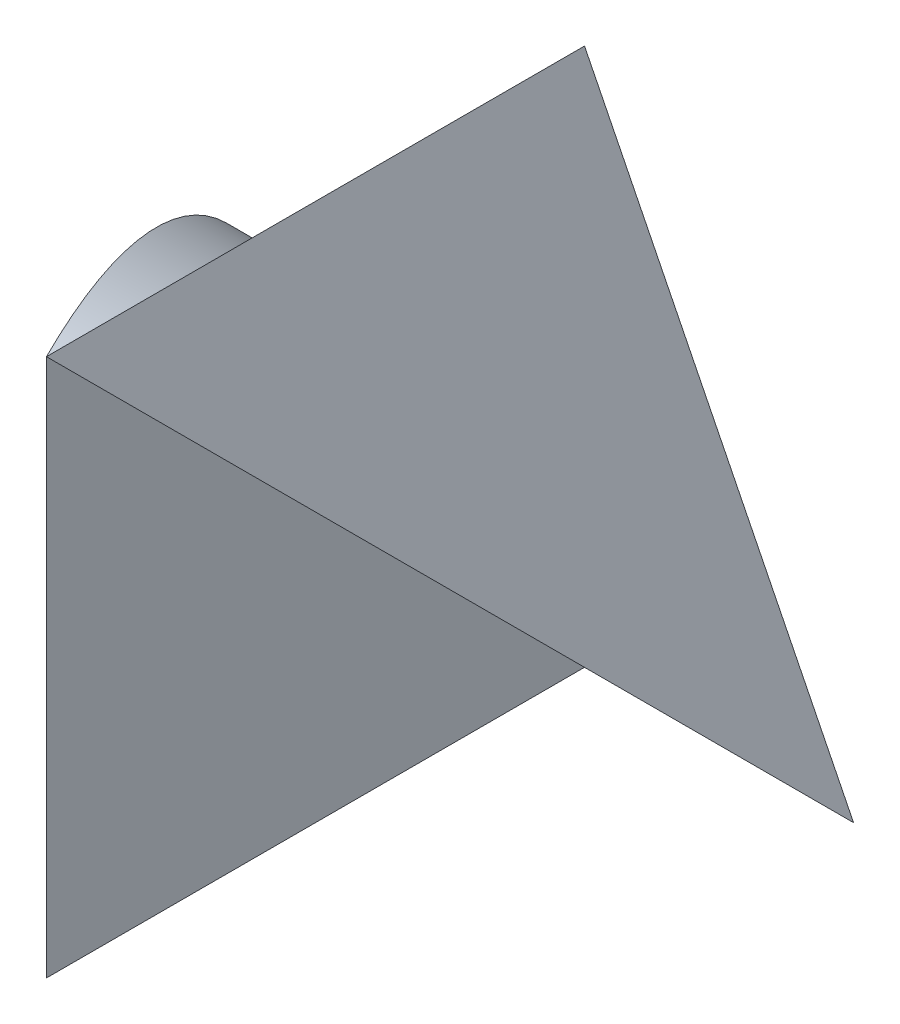
ISO-10303-21;
HEADER;
FILE_DESCRIPTION(('STEP AP214'),'2;1');
FILE_NAME('part.step','',(''),(''),'','','');
FILE_SCHEMA(('AUTOMOTIVE_DESIGN { 1 0 10303 214 1 1 1 1 }'));
ENDSEC;
DATA;
#1=APPLICATION_CONTEXT('core data for automotive mechanical design processes');
#2=APPLICATION_PROTOCOL_DEFINITION('international standard','automotive_design',2000,#1);
#3=PRODUCT_CONTEXT('',#1,'mechanical');
#4=PRODUCT('Part','Part','',(#3));
#5=PRODUCT_RELATED_PRODUCT_CATEGORY('part','',(#4));
#6=PRODUCT_DEFINITION_FORMATION('','',#4);
#7=PRODUCT_DEFINITION_CONTEXT('part definition',#1,'design');
#8=PRODUCT_DEFINITION('design','',#6,#7);
#9=PRODUCT_DEFINITION_SHAPE('','',#8);
#10=(LENGTH_UNIT() NAMED_UNIT(*) SI_UNIT(.MILLI.,.METRE.));
#11=(NAMED_UNIT(*) PLANE_ANGLE_UNIT() SI_UNIT($,.RADIAN.));
#12=(NAMED_UNIT(*) SI_UNIT($,.STERADIAN.) SOLID_ANGLE_UNIT());
#13=UNCERTAINTY_MEASURE_WITH_UNIT(LENGTH_MEASURE(1.E-05),#10,'distance_accuracy_value','');
#14=(GEOMETRIC_REPRESENTATION_CONTEXT(3) GLOBAL_UNCERTAINTY_ASSIGNED_CONTEXT((#13)) GLOBAL_UNIT_ASSIGNED_CONTEXT((#10,
#11,#12)) REPRESENTATION_CONTEXT('',''));
#15=CARTESIAN_POINT('',(0.,0.,0.));
#16=DIRECTION('',(0.,0.,1.));
#17=DIRECTION('',(1.,0.,0.));
#18=AXIS2_PLACEMENT_3D('',#15,#16,#17);
#19=CARTESIAN_POINT('',(-2.,4.,-2.));
#20=DIRECTION('',(0.,0.,1.));
#21=DIRECTION('',(1.,0.,0.));
#22=AXIS2_PLACEMENT_3D('',#19,#20,#21);
#23=PLANE('',#22);
#24=DIRECTION('',(0.,-1.,0.));
#25=VECTOR('',#24,1.);
#26=CARTESIAN_POINT('',(0.,4.,-2.));
#27=LINE('',#26,#25);
#28=CARTESIAN_POINT('',(0.,4.,-2.));
#29=VERTEX_POINT('',#28);
#30=CARTESIAN_POINT('',(0.,0.,-2.));
#31=VERTEX_POINT('',#30);
#32=EDGE_CURVE('E103',#29,#31,#27,.T.);
#33=ORIENTED_EDGE('',*,*,#32,.F.);
#34=DIRECTION('',(-0.447213595499958,0.894427190999916,0.));
#35=VECTOR('',#34,1.);
#36=CARTESIAN_POINT('',(0.,4.,-2.));
#37=LINE('',#36,#35);
#38=CARTESIAN_POINT('',(2.,0.,-2.));
#39=VERTEX_POINT('',#38);
#40=EDGE_CURVE('E47',#29,#39,#37,.F.);
#41=ORIENTED_EDGE('',*,*,#40,.T.);
#42=DIRECTION('',(-1.,0.,0.));
#43=VECTOR('',#42,1.);
#44=CARTESIAN_POINT('',(-2.,0.,-2.));
#45=LINE('',#44,#43);
#46=EDGE_CURVE('E80',#39,#31,#45,.T.);
#47=ORIENTED_EDGE('',*,*,#46,.T.);
#48=EDGE_LOOP('',(#33,#41,#47));
#49=FACE_BOUND('',#48,.T.);
#50=ADVANCED_FACE('F38',(#49),#23,.F.);
#51=CARTESIAN_POINT('',(0.,0.,0.));
#52=DIRECTION('',(0.,-1.,0.));
#53=DIRECTION('',(0.,0.,-1.));
#54=AXIS2_PLACEMENT_3D('',#51,#52,#53);
#55=PLANE('',#54);
#56=DIRECTION('',(0.,0.,-1.));
#57=VECTOR('',#56,1.);
#58=CARTESIAN_POINT('',(0.,0.,2.));
#59=LINE('',#58,#57);
#60=CARTESIAN_POINT('',(0.,0.,2.));
#61=VERTEX_POINT('',#60);
#62=EDGE_CURVE('E83',#61,#31,#59,.T.);
#63=ORIENTED_EDGE('',*,*,#62,.F.);
#64=DIRECTION('',(-0.447213595499958,0.,-0.894427190999916));
#65=VECTOR('',#64,1.);
#66=CARTESIAN_POINT('',(-2.,0.,-2.));
#67=LINE('',#66,#65);
#68=CARTESIAN_POINT('',(-2.,0.,-2.));
#69=VERTEX_POINT('',#68);
#70=EDGE_CURVE('E108',#61,#69,#67,.T.);
#71=ORIENTED_EDGE('',*,*,#70,.T.);
#72=DIRECTION('',(-1.,0.,0.));
#73=VECTOR('',#72,1.);
#74=CARTESIAN_POINT('',(-1.,0.,-1.99999999999999));
#75=LINE('',#74,#73);
#76=EDGE_CURVE('E55',#31,#69,#75,.T.);
#77=ORIENTED_EDGE('',*,*,#76,.F.);
#78=EDGE_LOOP('',(#63,#71,#77));
#79=FACE_BOUND('',#78,.T.);
#80=ADVANCED_FACE('F107',(#79),#55,.T.);
#81=CARTESIAN_POINT('',(-0.799999999999998,0.,0.399999999999999));
#82=DIRECTION('',(0.894427190999916,0.,-0.447213595499958));
#83=DIRECTION('',(-0.447213595499958,0.,-0.894427190999916));
#84=AXIS2_PLACEMENT_3D('',#81,#82,#83);
#85=PLANE('',#84);
#86=ORIENTED_EDGE('',*,*,#70,.F.);
#87=DIRECTION('',(0.,-1.,0.));
#88=VECTOR('',#87,1.);
#89=CARTESIAN_POINT('',(0.,0.,2.));
#90=LINE('',#89,#88);
#91=CARTESIAN_POINT('',(0.,3.99999999999955,2.));
#92=VERTEX_POINT('',#91);
#93=EDGE_CURVE('E88',#92,#61,#90,.T.);
#94=ORIENTED_EDGE('',*,*,#93,.F.);
#95=CARTESIAN_POINT('',(0.00684022848994022,-0.51710057122485,2.01368045697988));
#96=DIRECTION('',(0.894427190999916,0.,-0.447213595499958));
#97=DIRECTION('',(-0.447213595499958,0.,-0.894427190999916));
#98=AXIS2_PLACEMENT_3D('',#95,#96,#97);
#99=CIRCLE('',#98,4.51712646648163);
#100=EDGE_CURVE('E96',#69,#92,#99,.T.);
#101=ORIENTED_EDGE('',*,*,#100,.F.);
#102=EDGE_LOOP('',(#86,#94,#101));
#103=FACE_BOUND('',#102,.T.);
#104=ADVANCED_FACE('F151',(#103),#85,.F.);
#105=CARTESIAN_POINT('',(0.00684022848994022,-0.51710057122485,2.01368045697988));
#106=DIRECTION('',(0.894427190999916,0.,-0.447213595499958));
#107=DIRECTION('',(-0.447213595499958,0.,-0.894427190999916));
#108=AXIS2_PLACEMENT_3D('',#105,#106,#107);
#109=CIRCLE('',#108,4.51712646648163);
#110=DIRECTION('',(-1.,0.,0.));
#111=VECTOR('',#110,1.);
#112=SURFACE_OF_LINEAR_EXTRUSION('',#109,#111);
#113=CARTESIAN_POINT('',(0.,4.,2.00000000000056));
#114=CARTESIAN_POINT('',(-3.29164107437702E-06,3.99984146615886,1.95811665920226));
#115=CARTESIAN_POINT('',(-2.6812055542008E-06,3.9989546781095,1.91624182714234));
#116=CARTESIAN_POINT('',(-1.01992359139718E-06,3.99644465795736,1.85115828928925));
#117=CARTESIAN_POINT('',(-2.85660983740914E-07,3.9953243145802,1.82793011856197));
#118=CARTESIAN_POINT('',(5.85114411504305E-07,3.99122641728914,1.75716078923528));
#119=CARTESIAN_POINT('',(-7.11862012816379E-07,3.9875331231842,1.70965810114415));
#120=CARTESIAN_POINT('',(-2.86085527626709E-07,3.98124290870567,1.64522104602985));
#121=CARTESIAN_POINT('',(3.42406624948064E-08,3.97945986808995,1.62820326033033));
#122=CARTESIAN_POINT('',(-4.02359046206756E-08,3.97531987005972,1.59121708124602));
#123=CARTESIAN_POINT('',(-5.70071874366778E-07,3.97291708742537,1.57125377622062));
#124=CARTESIAN_POINT('',(-2.51853884411439E-06,3.96542476896231,1.51308150178726));
#125=CARTESIAN_POINT('',(-4.30665914576064E-06,3.95989200583473,1.4749287358988));
#126=CARTESIAN_POINT('',(-5.21156862370704E-06,3.94797163371294,1.40101231731437));
#127=CARTESIAN_POINT('',(-4.47638162051493E-06,3.94165167331328,1.36523770483343));
#128=CARTESIAN_POINT('',(-1.98612451534103E-06,3.92836668475956,1.29607569295097));
#129=CARTESIAN_POINT('',(-2.96205610419386E-07,3.92146478118423,1.26267615324556));
#130=CARTESIAN_POINT('',(3.36145648121476E-07,3.90573791725836,1.19159247116376));
#131=CARTESIAN_POINT('',(-1.12261538777678E-06,3.89677914120698,1.15393785239757));
#132=CARTESIAN_POINT('',(-2.88138930125311E-06,3.87800005933974,1.08019280013457));
#133=CARTESIAN_POINT('',(-3.2187525935735E-06,3.86821890248507,1.04409237842413));
#134=CARTESIAN_POINT('',(-2.47140314842316E-06,3.84792556020936,0.973456615589084));
#135=CARTESIAN_POINT('',(-1.43582271187529E-06,3.83745071308112,0.938910564411744));
#136=CARTESIAN_POINT('',(-3.32048758234865E-07,3.82113600412024,0.887798319178649));
#137=CARTESIAN_POINT('',(-4.01695734436056E-08,3.81567832094497,0.871109255899427));
#138=CARTESIAN_POINT('',(4.39294931877282E-08,3.80400569869928,0.836251491528405));
#139=CARTESIAN_POINT('',(-2.13176572972792E-07,3.7977676953528,0.818090510616332));
#140=CARTESIAN_POINT('',(-1.07881289220894E-06,3.7788532203558,0.764375349843778));
#141=CARTESIAN_POINT('',(-1.78694139841112E-06,3.76577657421834,0.728961184810501));
#142=CARTESIAN_POINT('',(-2.18182061547266E-06,3.73887890574863,0.659361332985203));
#143=CARTESIAN_POINT('',(-1.89191392947399E-06,3.72508222930143,0.625166218502202));
#144=CARTESIAN_POINT('',(-8.33891483664417E-07,3.69683545712451,0.558003233034437));
#145=CARTESIAN_POINT('',(-7.73267971342213E-08,3.68240874236399,0.52502552760153));
#146=CARTESIAN_POINT('',(8.05404642946845E-08,3.65200714404022,0.458130691515223));
#147=CARTESIAN_POINT('',(-5.75782122010789E-07,3.63599283843783,0.424231470552301));
#148=CARTESIAN_POINT('',(-1.40634637895907E-06,3.60324874075722,0.357471168860361));
#149=CARTESIAN_POINT('',(-1.58834070549006E-06,3.58653505201647,0.324602183943019));
#150=CARTESIAN_POINT('',(-1.24100983729462E-06,3.55246105507642,0.259902562796925));
#151=CARTESIAN_POINT('',(-7.2355307887486E-07,3.53511627536296,0.22806375646945));
#152=CARTESIAN_POINT('',(-1.63525198829744E-07,3.50855135449851,0.180881697160631));
#153=CARTESIAN_POINT('',(-1.3168802795037E-08,3.49966475155822,0.165349775304775));
#154=CARTESIAN_POINT('',(1.37631482900038E-08,3.48127304473371,0.133711298415831));
#155=CARTESIAN_POINT('',(-1.22324138960972E-07,3.47175812795835,0.117610446847483));
#156=CARTESIAN_POINT('',(-5.93391705781465E-07,3.44304586824174,0.0698085693629209));
#157=CARTESIAN_POINT('',(-9.92478485066886E-07,3.42351244433432,0.03830855834919));
#158=CARTESIAN_POINT('',(-1.22386820435125E-06,3.38381476144611,-0.0237431254706387));
#159=CARTESIAN_POINT('',(-1.06311807809924E-06,3.36366128860763,-0.0543017082398164));
#160=CARTESIAN_POINT('',(-4.63674693341282E-07,3.32277873198991,-0.114471440145975));
#161=CARTESIAN_POINT('',(-2.85009940419858E-08,3.30206006957944,-0.144089670381376));
#162=CARTESIAN_POINT('',(2.95736345276804E-08,3.25903641769627,-0.203860341915548));
#163=CARTESIAN_POINT('',(-3.78711942874007E-07,3.23670107256991,-0.233990936697788));
#164=CARTESIAN_POINT('',(-9.0618759910093E-07,3.19141560375243,-0.293341462420559));
#165=CARTESIAN_POINT('',(-1.02804598654785E-06,3.16847318437088,-0.322567275158875));
#166=CARTESIAN_POINT('',(-8.08889607939719E-07,3.12202161049627,-0.380108227403019));
#167=CARTESIAN_POINT('',(-4.72261823047247E-07,3.09851991202909,-0.40842938120263));
#168=CARTESIAN_POINT('',(-1.05624310989168E-07,3.06279213935972,-0.45032955674006));
#169=CARTESIAN_POINT('',(-6.57515846237557E-09,3.05084809528385,-0.464149994240835));
#170=CARTESIAN_POINT('',(6.73057578342323E-09,3.0264937012796,-0.491956422569549));
#171=CARTESIAN_POINT('',(-8.34362085534386E-08,3.01407900255387,-0.505938604778063));
#172=CARTESIAN_POINT('',(-3.98871651218423E-07,2.97668625685619,-0.547484872725231));
#173=CARTESIAN_POINT('',(-6.69545992275417E-07,2.9514305837486,-0.574799975232105));
#174=CARTESIAN_POINT('',(-8.28714259016235E-07,2.90038539664122,-0.628555644512435));
#175=CARTESIAN_POINT('',(-7.19927156415904E-07,2.87460099125579,-0.655001068080568));
#176=CARTESIAN_POINT('',(-3.13515497045921E-07,2.82253905563688,-0.707018088500668));
#177=CARTESIAN_POINT('',(-1.72711245160681E-08,2.7962664804343,-0.732594644429743));
#178=CARTESIAN_POINT('',(1.73977441267633E-08,2.7428772256415,-0.783246666980354));
#179=CARTESIAN_POINT('',(-2.48263797825452E-07,2.71575578565744,-0.808317115527931));
#180=CARTESIAN_POINT('',(-5.92916909060562E-07,2.66102407625731,-0.857619690580522));
#181=CARTESIAN_POINT('',(-6.72900107936554E-07,2.63341720068951,-0.881855586232264));
#182=CARTESIAN_POINT('',(-5.31013389987732E-07,2.57774978004029,-0.929489048655185));
#183=CARTESIAN_POINT('',(-3.10790179985201E-07,2.54969253744162,-0.952890472045983));
#184=CARTESIAN_POINT('',(-6.88918290633788E-08,2.5072340477865,-0.987412070125174));
#185=CARTESIAN_POINT('',(-3.04443883813699E-09,2.49304915467313,-0.998799309088329));
#186=CARTESIAN_POINT('',(3.08729118492329E-09,2.46433854129383,-1.02155599516039));
#187=CARTESIAN_POINT('',(-5.84088650731667E-08,2.44981083406234,-1.03292293557085));
#188=CARTESIAN_POINT('',(-2.69205794945657E-07,2.40610427468595,-1.06668108149518));
#189=CARTESIAN_POINT('',(-4.45027070944733E-07,2.37671478968274,-1.08880051142679));
#190=CARTESIAN_POINT('',(-5.78371979315198E-07,2.31751947736873,-1.13221460942739));
#191=CARTESIAN_POINT('',(-5.36792077634356E-07,2.28771586445182,-1.15351230024117));
#192=CARTESIAN_POINT('',(-1.70091142993686E-07,2.22772349207068,-1.19528339711358));
#193=CARTESIAN_POINT('',(1.53829659429889E-07,2.19753689529089,-1.21575990906333));
#194=CARTESIAN_POINT('',(-1.57308487640856E-07,2.13598926707287,-1.25643179974529));
#195=CARTESIAN_POINT('',(-8.14220231653206E-07,2.1046171143355,-1.27661034842445));
#196=CARTESIAN_POINT('',(-2.64916269830888E-06,2.04146631010504,-1.31614220323484));
#197=CARTESIAN_POINT('',(-3.82588656038769E-06,2.00968887088906,-1.33549744629771));
#198=CARTESIAN_POINT('',(-5.74557240594543E-06,1.94575664156997,-1.37338108476755));
#199=CARTESIAN_POINT('',(-6.48965520015561E-06,1.91360304864395,-1.39191150080873));
#200=CARTESIAN_POINT('',(-7.21927922987406E-06,1.84894735292778,-1.42814465693884));
#201=CARTESIAN_POINT('',(-7.20687024112017E-06,1.81644643045638,-1.44584950354782));
#202=CARTESIAN_POINT('',(-6.42723536624465E-06,1.75112456414844,-1.48043146380156));
#203=CARTESIAN_POINT('',(-5.66213891994406E-06,1.71830478173757,-1.49731077158762));
#204=CARTESIAN_POINT('',(-3.75439127316465E-06,1.65237331449783,-1.53024234435711));
#205=CARTESIAN_POINT('',(-2.61285538012723E-06,1.61926276987239,-1.54629689243988));
#206=CARTESIAN_POINT('',(-7.59536361258185E-07,1.55277751449549,-1.5775803593606));
#207=CARTESIAN_POINT('',(-4.64506805561306E-08,1.51940392013972,-1.59281165119898));
#208=CARTESIAN_POINT('',(4.66072046110361E-08,1.45220050274353,-1.62254779919771));
#209=CARTESIAN_POINT('',(-5.77909458608065E-07,1.41836952327954,-1.63705004161511));
#210=CARTESIAN_POINT('',(-2.07229142512015E-06,1.35042358248429,-1.66525265509175));
#211=CARTESIAN_POINT('',(-2.94185530471399E-06,1.31630901970102,-1.67895398647749));
#212=CARTESIAN_POINT('',(-4.39280099622135E-06,1.24782058842959,-1.70555352088064));
#213=CARTESIAN_POINT('',(-4.9745654478698E-06,1.21344712626049,-1.71845277022474));
#214=CARTESIAN_POINT('',(-5.54680113678249E-06,1.14446539125761,-1.74344747977582));
#215=CARTESIAN_POINT('',(-5.53812514048622E-06,1.10985752924995,-1.75554407395537));
#216=CARTESIAN_POINT('',(-4.94226066617595E-06,1.04043128621515,-1.77893340062698));
#217=CARTESIAN_POINT('',(-4.35597343005014E-06,1.00561331712659,-1.79022735603814));
#218=CARTESIAN_POINT('',(-2.8936765794912E-06,0.935790929270088,-1.81201190985205));
#219=CARTESIAN_POINT('',(-2.01815347412928E-06,0.900786920054331,-1.82250382108674));
#220=CARTESIAN_POINT('',(-5.8193989822175E-07,0.83061630104928,-1.84268535268954));
#221=CARTESIAN_POINT('',(-2.06883118815106E-08,0.795450094813771,-1.8523763764505));
#222=CARTESIAN_POINT('',(2.09277980261846E-08,0.724502967852005,-1.87108318406355));
#223=CARTESIAN_POINT('',(-5.11295282532811E-07,0.68871964360355,-1.88008985266713));
#224=CARTESIAN_POINT('',(-1.81131403219656E-06,0.616975214559516,-1.89729716079785));
#225=CARTESIAN_POINT('',(-2.5790133468327E-06,0.58101418838858,-1.90549812820081));
#226=CARTESIAN_POINT('',(-3.85914566266184E-06,0.508937297032538,-1.92109291443517));
#227=CARTESIAN_POINT('',(-4.37171224804542E-06,0.47282152288392,-1.92848715407183));
#228=CARTESIAN_POINT('',(-4.87913501747973E-06,0.400458005543596,-1.94246788146291));
#229=CARTESIAN_POINT('',(-4.87432288244238E-06,0.364210361796829,-1.94905488400857));
#230=CARTESIAN_POINT('',(-4.35611187908047E-06,0.291605869848962,-1.96142105259961));
#231=CARTESIAN_POINT('',(-3.84309914580854E-06,0.255249125452742,-1.96720082817856));
#232=CARTESIAN_POINT('',(-2.55269068368955E-06,0.182449090540632,-1.97795295958252));
#233=CARTESIAN_POINT('',(-1.77552757579412E-06,0.14600590409418,-1.98292602015866));
#234=CARTESIAN_POINT('',(-5.2201429687206E-07,0.0730554901819399,-1.99206567356129));
#235=CARTESIAN_POINT('',(-4.53646055603804E-08,0.0365483629646019,-1.99623306651041));
#236=CARTESIAN_POINT('',(0.,0.,-1.99999999999999));
#237=B_SPLINE_CURVE_WITH_KNOTS('',3,(#113,#114,#115,#116,#117,#118,#119,#120,#121,#122,#123,
#124,#125,#126,#127,#128,#129,#130,#131,#132,#133,#134,#135,#136,#137,#138,#139,#140,#141,#142,
#143,#144,#145,#146,#147,#148,#149,#150,#151,#152,#153,#154,#155,#156,#157,#158,#159,#160,#161,
#162,#163,#164,#165,#166,#167,#168,#169,#170,#171,#172,#173,#174,#175,#176,#177,#178,#179,#180,
#181,#182,#183,#184,#185,#186,#187,#188,#189,#190,#191,#192,#193,#194,#195,#196,#197,#198,#199,
#200,#201,#202,#203,#204,#205,#206,#207,#208,#209,#210,#211,#212,#213,#214,#215,#216,#217,#218,
#219,#220,#221,#222,#223,#224,#225,#226,#227,#228,#229,#230,#231,#232,#233,#234,#235,#236),
.UNSPECIFIED.,.F.,.F.,(4,2,2,2,2,2,2,2,2,2,2,2,2,2,2,2,2,2,2,2,2,2,2,2,2,2,2,2,2,2,2,2,2,2,2,2,
2,2,2,2,2,2,2,2,2,2,2,2,2,2,2,2,2,2,2,2,2,2,2,2,2,4),(0.,0.125633008249173,0.195395160690803,
0.338287761495817,0.389619558175016,0.449939113757434,0.565573521673274,0.674543274022359,
0.776845967305749,0.89294304371918,1.00513232302025,1.11341319477351,1.16608808369644,
1.22369340830443,1.33692859628769,1.44753354548471,1.55550486439908,1.66796299196981,
1.77857117666071,1.88732590650047,1.94100789517136,1.99711271630199,2.1082912729259,
2.21809517272756,2.32651867601552,2.43902272914298,2.55047448602263,2.66086728570712,
2.71566538806906,2.77175877762307,2.88334932449903,2.99414193427909,3.10412815886353,
3.2149169240769,3.32511263844217,3.4347063278816,3.48927548130516,3.5446127603963,
3.654950267953,3.76483315235456,3.87425119052091,3.98614369536304,4.0977564780285,
4.20907881050749,4.32009951955487,4.43080703879931,4.54118945948632,4.65123457985715,
4.76164957981218,4.87192935070925,4.98206210395152,5.09203579708838,5.20183817052777,
5.31145678340346,5.42087904861364,5.53156799053292,5.6422116999546,5.75279741666524,
5.86331223955851,5.97374315672318,6.08407707507732,6.19430084956822),.UNSPECIFIED.);
#238=EDGE_CURVE('E82',#31,#92,#237,.F.);
#239=ORIENTED_EDGE('',*,*,#238,.F.);
#240=ORIENTED_EDGE('',*,*,#76,.T.);
#241=ORIENTED_EDGE('',*,*,#100,.T.);
#242=EDGE_LOOP('',(#239,#240,#241));
#243=FACE_BOUND('',#242,.T.);
#244=ADVANCED_FACE('F95',(#243),#112,.F.);
#245=CARTESIAN_POINT('',(0.,2.84976670944731,-0.679813367557779));
#246=DIRECTION('',(-1.,0.,0.));
#247=DIRECTION('',(0.,0.,1.));
#248=AXIS2_PLACEMENT_3D('',#245,#246,#247);
#249=PLANE('',#248);
#250=ORIENTED_EDGE('',*,*,#238,.T.);
#251=DIRECTION('',(0.,0.,-1.));
#252=VECTOR('',#251,1.);
#253=CARTESIAN_POINT('',(0.,4.,2.));
#254=LINE('',#253,#252);
#255=EDGE_CURVE('E99',#92,#29,#254,.T.);
#256=ORIENTED_EDGE('',*,*,#255,.T.);
#257=ORIENTED_EDGE('',*,*,#32,.T.);
#258=EDGE_LOOP('',(#250,#256,#257));
#259=FACE_BOUND('',#258,.T.);
#260=ADVANCED_FACE('F104',(#259),#249,.T.);
#261=CARTESIAN_POINT('',(0.,4.,0.));
#262=DIRECTION('',(-0.894427190999916,-0.447213595499958,0.));
#263=DIRECTION('',(0.,0.,-1.));
#264=AXIS2_PLACEMENT_3D('',#261,#262,#263);
#265=PLANE('',#264);
#266=DIRECTION('',(0.333333333333312,-0.666666666666625,-0.666666666666719));
#267=VECTOR('',#266,1.);
#268=CARTESIAN_POINT('',(0.444444444444576,3.11111111111085,1.11111111111129));
#269=LINE('',#268,#267);
#270=EDGE_CURVE('E14',#39,#92,#269,.F.);
#271=ORIENTED_EDGE('',*,*,#270,.F.);
#272=ORIENTED_EDGE('',*,*,#40,.F.);
#273=ORIENTED_EDGE('',*,*,#255,.F.);
#274=EDGE_LOOP('',(#271,#272,#273));
#275=FACE_BOUND('',#274,.T.);
#276=ADVANCED_FACE('F40',(#275),#265,.F.);
#277=CARTESIAN_POINT('',(10.,0.,-2.));
#278=DIRECTION('',(0.,-0.707106781186588,0.707106781186507));
#279=DIRECTION('',(0.,-0.707106781186507,-0.707106781186588));
#280=AXIS2_PLACEMENT_3D('',#277,#278,#279);
#281=PLANE('',#280);
#282=ORIENTED_EDGE('',*,*,#270,.T.);
#283=DIRECTION('',(0.,0.707106781186507,0.707106781186588));
#284=VECTOR('',#283,1.);
#285=CARTESIAN_POINT('',(0.,0.,-2.));
#286=LINE('',#285,#284);
#287=EDGE_CURVE('E76',#31,#92,#286,.T.);
#288=ORIENTED_EDGE('',*,*,#287,.F.);
#289=ORIENTED_EDGE('',*,*,#46,.F.);
#290=EDGE_LOOP('',(#282,#288,#289));
#291=FACE_BOUND('',#290,.T.);
#292=ADVANCED_FACE('F78',(#291),#281,.T.);
#293=CARTESIAN_POINT('',(0.,0.,0.));
#294=DIRECTION('',(-1.,0.,0.));
#295=DIRECTION('',(0.,0.,1.));
#296=AXIS2_PLACEMENT_3D('',#293,#294,#295);
#297=PLANE('',#296);
#298=ORIENTED_EDGE('',*,*,#62,.T.);
#299=ORIENTED_EDGE('',*,*,#287,.T.);
#300=ORIENTED_EDGE('',*,*,#93,.T.);
#301=EDGE_LOOP('',(#298,#299,#300));
#302=FACE_BOUND('',#301,.T.);
#303=ADVANCED_FACE('F86',(#302),#297,.F.);
#304=CLOSED_SHELL('',(#50,#80,#104,#244,#260,#276,#292,#303));
#305=MANIFOLD_SOLID_BREP('B2',#304);
#306=ADVANCED_BREP_SHAPE_REPRESENTATION('',(#18,#305),#14);
#307=SHAPE_DEFINITION_REPRESENTATION(#9,#306);
ENDSEC;
END-ISO-10303-21;
